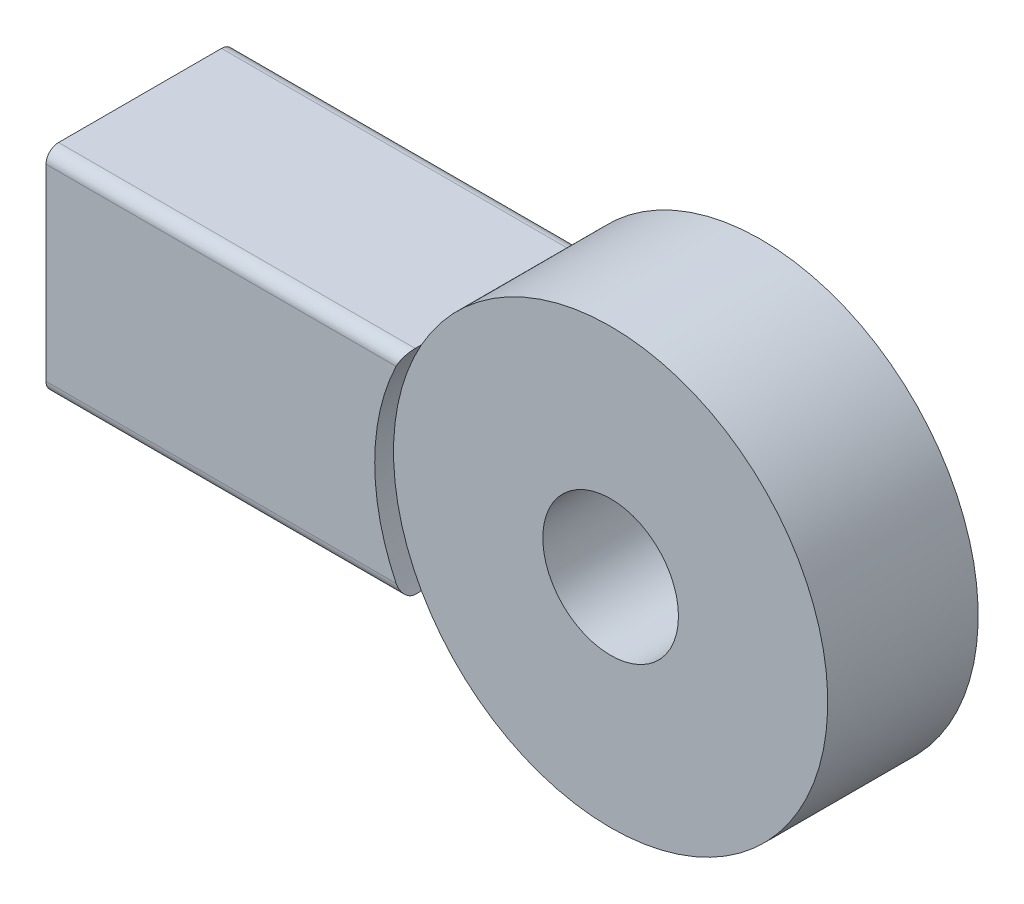
ISO-10303-21;
HEADER;
FILE_DESCRIPTION(('STEP AP214'),'2;1');
FILE_NAME('part.step','',(''),(''),'','','');
FILE_SCHEMA(('AUTOMOTIVE_DESIGN { 1 0 10303 214 1 1 1 1 }'));
ENDSEC;
DATA;
#1=APPLICATION_CONTEXT('core data for automotive mechanical design processes');
#2=APPLICATION_PROTOCOL_DEFINITION('international standard','automotive_design',2000,#1);
#3=PRODUCT_CONTEXT('',#1,'mechanical');
#4=PRODUCT('Part','Part','',(#3));
#5=PRODUCT_RELATED_PRODUCT_CATEGORY('part','',(#4));
#6=PRODUCT_DEFINITION_FORMATION('','',#4);
#7=PRODUCT_DEFINITION_CONTEXT('part definition',#1,'design');
#8=PRODUCT_DEFINITION('design','',#6,#7);
#9=PRODUCT_DEFINITION_SHAPE('','',#8);
#10=(LENGTH_UNIT() NAMED_UNIT(*) SI_UNIT(.MILLI.,.METRE.));
#11=(NAMED_UNIT(*) PLANE_ANGLE_UNIT() SI_UNIT($,.RADIAN.));
#12=(NAMED_UNIT(*) SI_UNIT($,.STERADIAN.) SOLID_ANGLE_UNIT());
#13=UNCERTAINTY_MEASURE_WITH_UNIT(LENGTH_MEASURE(1.E-05),#10,'distance_accuracy_value','');
#14=(GEOMETRIC_REPRESENTATION_CONTEXT(3) GLOBAL_UNCERTAINTY_ASSIGNED_CONTEXT((#13)) GLOBAL_UNIT_ASSIGNED_CONTEXT((#10,
#11,#12)) REPRESENTATION_CONTEXT('',''));
#15=CARTESIAN_POINT('',(0.,0.,0.));
#16=DIRECTION('',(0.,0.,1.));
#17=DIRECTION('',(1.,0.,0.));
#18=AXIS2_PLACEMENT_3D('',#15,#16,#17);
#19=CARTESIAN_POINT('',(0.,0.,6.));
#20=DIRECTION('',(0.,0.,-1.));
#21=DIRECTION('',(-1.,0.,0.));
#22=AXIS2_PLACEMENT_3D('',#19,#20,#21);
#23=CYLINDRICAL_SURFACE('',#22,17.3188793455627);
#24=DIRECTION('',(0.,0.,-1.));
#25=VECTOR('',#24,1.);
#26=CARTESIAN_POINT('',(-15.0905273458114,8.49820958857791,7.5));
#27=LINE('',#26,#25);
#28=CARTESIAN_POINT('',(-15.090527345814,8.49820958857791,6.));
#29=VERTEX_POINT('',#28);
#30=CARTESIAN_POINT('',(-15.090527345814,8.49820958857791,-6.));
#31=VERTEX_POINT('',#30);
#32=EDGE_CURVE('E210',#29,#31,#27,.T.);
#33=ORIENTED_EDGE('',*,*,#32,.F.);
#34=CARTESIAN_POINT('',(0.,0.,6.));
#35=DIRECTION('',(0.,0.,1.));
#36=DIRECTION('',(1.,0.,0.));
#37=AXIS2_PLACEMENT_3D('',#34,#35,#36);
#38=CIRCLE('',#37,17.3188793455627);
#39=CARTESIAN_POINT('',(-15.0905273458165,-8.49820958857336,6.));
#40=VERTEX_POINT('',#39);
#41=EDGE_CURVE('E214',#40,#29,#38,.T.);
#42=ORIENTED_EDGE('',*,*,#41,.F.);
#43=DIRECTION('',(0.,0.,-1.));
#44=VECTOR('',#43,1.);
#45=CARTESIAN_POINT('',(-15.0905273458114,-8.49820958857336,7.5));
#46=LINE('',#45,#44);
#47=CARTESIAN_POINT('',(-15.0905273458114,-8.49820958857336,-6.));
#48=VERTEX_POINT('',#47);
#49=EDGE_CURVE('E200',#40,#48,#46,.T.);
#50=ORIENTED_EDGE('',*,*,#49,.T.);
#51=CARTESIAN_POINT('',(0.,0.,-6.));
#52=DIRECTION('',(0.,0.,1.));
#53=DIRECTION('',(1.,0.,0.));
#54=AXIS2_PLACEMENT_3D('',#51,#52,#53);
#55=CIRCLE('',#54,17.3188793455627);
#56=EDGE_CURVE('E222',#48,#31,#55,.T.);
#57=ORIENTED_EDGE('',*,*,#56,.T.);
#58=EDGE_LOOP('',(#33,#42,#50,#57));
#59=FACE_BOUND('',#58,.T.);
#60=ADVANCED_FACE('F37',(#59),#23,.T.);
#61=CARTESIAN_POINT('',(0.,0.,6.));
#62=DIRECTION('',(0.,0.,-1.));
#63=DIRECTION('',(-1.,0.,0.));
#64=AXIS2_PLACEMENT_3D('',#61,#62,#63);
#65=CYLINDRICAL_SURFACE('',#64,5.41173144118846);
#66=CARTESIAN_POINT('',(0.,0.,6.));
#67=DIRECTION('',(0.,0.,1.));
#68=DIRECTION('',(1.,0.,0.));
#69=AXIS2_PLACEMENT_3D('',#66,#67,#68);
#70=CIRCLE('',#69,5.41173144118846);
#71=CARTESIAN_POINT('',(5.41173144118846,0.,6.));
#72=VERTEX_POINT('',#71);
#73=EDGE_CURVE('E211',#72,#72,#70,.T.);
#74=ORIENTED_EDGE('',*,*,#73,.T.);
#75=EDGE_LOOP('',(#74));
#76=FACE_BOUND('',#75,.T.);
#77=CARTESIAN_POINT('',(0.,0.,-6.));
#78=DIRECTION('',(0.,0.,1.));
#79=DIRECTION('',(1.,0.,0.));
#80=AXIS2_PLACEMENT_3D('',#77,#78,#79);
#81=CIRCLE('',#80,5.41173144118846);
#82=CARTESIAN_POINT('',(5.41173144118846,0.,-6.));
#83=VERTEX_POINT('',#82);
#84=EDGE_CURVE('E209',#83,#83,#81,.T.);
#85=ORIENTED_EDGE('',*,*,#84,.F.);
#86=EDGE_LOOP('',(#85));
#87=FACE_BOUND('',#86,.T.);
#88=ADVANCED_FACE('F274',(#76,#87),#65,.F.);
#89=CARTESIAN_POINT('',(0.,0.,6.));
#90=DIRECTION('',(0.,0.,1.));
#91=DIRECTION('',(1.,0.,0.));
#92=AXIS2_PLACEMENT_3D('',#89,#90,#91);
#93=PLANE('',#92);
#94=ORIENTED_EDGE('',*,*,#73,.F.);
#95=EDGE_LOOP('',(#94));
#96=FACE_BOUND('',#95,.T.);
#97=EDGE_CURVE('E216',#29,#40,#38,.T.);
#98=ORIENTED_EDGE('',*,*,#97,.T.);
#99=ORIENTED_EDGE('',*,*,#41,.T.);
#100=EDGE_LOOP('',(#98,#99));
#101=FACE_BOUND('',#100,.T.);
#102=ADVANCED_FACE('F280',(#96,#101),#93,.T.);
#103=CARTESIAN_POINT('',(0.,0.,-6.));
#104=DIRECTION('',(0.,0.,1.));
#105=DIRECTION('',(1.,0.,0.));
#106=AXIS2_PLACEMENT_3D('',#103,#104,#105);
#107=PLANE('',#106);
#108=ORIENTED_EDGE('',*,*,#84,.T.);
#109=EDGE_LOOP('',(#108));
#110=FACE_BOUND('',#109,.T.);
#111=EDGE_CURVE('E215',#31,#48,#55,.T.);
#112=ORIENTED_EDGE('',*,*,#111,.F.);
#113=ORIENTED_EDGE('',*,*,#56,.F.);
#114=EDGE_LOOP('',(#112,#113));
#115=FACE_BOUND('',#114,.T.);
#116=ADVANCED_FACE('F284',(#110,#115),#107,.F.);
#117=CARTESIAN_POINT('',(0.,0.,7.5));
#118=DIRECTION('',(0.,0.,-1.));
#119=DIRECTION('',(-1.,0.,0.));
#120=AXIS2_PLACEMENT_3D('',#117,#118,#119);
#121=CYLINDRICAL_SURFACE('',#120,17.3188793455627);
#122=CARTESIAN_POINT('',(0.,0.,-7.5));
#123=DIRECTION('',(0.,0.,1.));
#124=DIRECTION('',(1.,0.,0.));
#125=AXIS2_PLACEMENT_3D('',#122,#123,#124);
#126=CIRCLE('',#125,17.3188793455627);
#127=CARTESIAN_POINT('',(-15.6115481215642,7.49820958857791,-7.5));
#128=VERTEX_POINT('',#127);
#129=CARTESIAN_POINT('',(-15.6115481215664,-7.49820958857336,-7.5));
#130=VERTEX_POINT('',#129);
#131=EDGE_CURVE('E182',#128,#130,#126,.T.);
#132=ORIENTED_EDGE('',*,*,#131,.F.);
#133=CARTESIAN_POINT('',(-15.6115481215642,7.49820958857791,-7.5));
#134=CARTESIAN_POINT('',(-15.5817086899096,7.56037293676821,-7.50001226886464));
#135=CARTESIAN_POINT('',(-15.5514711763874,7.62234182119367,-7.49420452643146));
#136=CARTESIAN_POINT('',(-15.4910711134956,7.74433949699365,-7.47122314782866));
#137=CARTESIAN_POINT('',(-15.4609088554028,7.80436393539289,-7.45402564056226));
#138=CARTESIAN_POINT('',(-15.4016380076448,7.92069658419375,-7.40852148658468));
#139=CARTESIAN_POINT('',(-15.3725303574758,7.97700151613102,-7.38020518818983));
#140=CARTESIAN_POINT('',(-15.31651251662,8.08403751102646,-7.31289391765487));
#141=CARTESIAN_POINT('',(-15.2896008204767,8.13477240096261,-7.27390634252119));
#142=CARTESIAN_POINT('',(-15.2403475105873,8.22666356507234,-7.18785192815008));
#143=CARTESIAN_POINT('',(-15.2178561007495,8.26814496664267,-7.14122033384483));
#144=CARTESIAN_POINT('',(-15.1772897478211,8.34237687893656,-7.03974223449718));
#145=CARTESIAN_POINT('',(-15.1592123652538,8.37513221316412,-6.98490029418177));
#146=CARTESIAN_POINT('',(-15.1305913219278,8.42671685691229,-6.87561109888433));
#147=CARTESIAN_POINT('',(-15.1194069344571,8.44673990899789,-6.82189430691827));
#148=CARTESIAN_POINT('',(-15.1022668972775,8.47734818767464,-6.71110910815172));
#149=CARTESIAN_POINT('',(-15.0962966953305,8.48795968221793,-6.65405050662919));
#150=CARTESIAN_POINT('',(-15.0922773946951,8.4951012390661,-6.58043265323197));
#151=CARTESIAN_POINT('',(-15.0916212223593,8.49626686184314,-6.56436413889287));
#152=CARTESIAN_POINT('',(-15.0907468987479,8.49781980836139,-6.53219978678613));
#153=CARTESIAN_POINT('',(-15.0905281466029,8.49820819975973,-6.51610401694004));
#154=CARTESIAN_POINT('',(-15.090527345814,8.49820958857791,-6.49999999999986));
#155=B_SPLINE_CURVE_WITH_KNOTS('',3,(#133,#134,#135,#136,#137,#138,#139,#140,#141,#142,#143,
#144,#145,#146,#147,#148,#149,#150,#151,#152,#153,#154),.UNSPECIFIED.,.F.,.F.,(4,2,2,2,2,2,2,2,
2,2,4),(0.,0.206621395314043,0.413677211717414,0.620913161992713,0.828005824783278,
1.02590954804697,1.22370364810248,1.39794753619491,1.57170355968314,1.62005946754448,
1.66834890476721),.UNSPECIFIED.);
#156=CARTESIAN_POINT('',(-15.0905273458114,8.49820958857791,-6.5));
#157=VERTEX_POINT('',#156);
#158=EDGE_CURVE('E248',#128,#157,#155,.T.);
#159=ORIENTED_EDGE('',*,*,#158,.T.);
#160=EDGE_CURVE('E206',#31,#157,#27,.T.);
#161=ORIENTED_EDGE('',*,*,#160,.F.);
#162=ORIENTED_EDGE('',*,*,#111,.T.);
#163=CARTESIAN_POINT('',(-15.0905273458114,-8.49820958857336,-6.5));
#164=VERTEX_POINT('',#163);
#165=EDGE_CURVE('E192',#48,#164,#46,.T.);
#166=ORIENTED_EDGE('',*,*,#165,.T.);
#167=CARTESIAN_POINT('',(-15.0905273458114,-8.49820958857336,-6.5));
#168=CARTESIAN_POINT('',(-15.090526070343,-8.49821110936551,-6.52564127106686));
#169=CARTESIAN_POINT('',(-15.0910831841491,-8.4972226419363,-6.55126905412679));
#170=CARTESIAN_POINT('',(-15.0932966633545,-8.49329060426034,-6.6023175464394));
#171=CARTESIAN_POINT('',(-15.0949526431046,-8.49034771991979,-6.62773832517346));
#172=CARTESIAN_POINT('',(-15.1015202935907,-8.47866442954377,-6.70318406085138));
#173=CARTESIAN_POINT('',(-15.1080320822721,-8.46706878591032,-6.75266327798923));
#174=CARTESIAN_POINT('',(-15.1249403653583,-8.43682733703322,-6.84861177784481));
#175=CARTESIAN_POINT('',(-15.1353331797248,-8.41818821031142,-6.89508386314132));
#176=CARTESIAN_POINT('',(-15.1594741224144,-8.37463697649515,-6.98407792627637));
#177=CARTESIAN_POINT('',(-15.1732252333337,-8.34971929261212,-7.02659634615031));
#178=CARTESIAN_POINT('',(-15.2043010681082,-8.29300360666035,-7.10904934097898));
#179=CARTESIAN_POINT('',(-15.2217791462088,-8.26090576966955,-7.14871875964377));
#180=CARTESIAN_POINT('',(-15.2591021406383,-8.19175976285045,-7.22217385246548));
#181=CARTESIAN_POINT('',(-15.2789477506868,-8.15471014169633,-7.25595779492697));
#182=CARTESIAN_POINT('',(-15.3228946338098,-8.07186057538483,-7.32098972172137));
#183=CARTESIAN_POINT('',(-15.3472198973286,-8.02554445021885,-7.35142884830177));
#184=CARTESIAN_POINT('',(-15.3972613667249,-7.92911627829938,-7.40406912486916));
#185=CARTESIAN_POINT('',(-15.4229785286742,-7.8790016126821,-7.42626452794686));
#186=CARTESIAN_POINT('',(-15.4758705875815,-7.77460665379668,-7.4626783094066));
#187=CARTESIAN_POINT('',(-15.5030660743388,-7.72024653887368,-7.47663775385149));
#188=CARTESIAN_POINT('',(-15.5574635926515,-7.61004451272393,-7.4952977335234));
#189=CARTESIAN_POINT('',(-15.5846655789739,-7.55420441756711,-7.5000091281706));
#190=CARTESIAN_POINT('',(-15.6115481215664,-7.49820958857336,-7.5));
#191=B_SPLINE_CURVE_WITH_KNOTS('',3,(#167,#168,#169,#170,#171,#172,#173,#174,#175,#176,#177,
#178,#179,#180,#181,#182,#183,#184,#185,#186,#187,#188,#189,#190),.UNSPECIFIED.,.F.,.F.,(4,2,2,
2,2,2,2,2,2,2,2,4),(0.,0.076872527578372,0.153718090848827,0.306607807097266,0.459352917954637,
0.612234182484493,0.773406033554011,0.934625226738537,1.11546271867021,1.29642604144407,
1.48281140739806,1.668977781161),.UNSPECIFIED.);
#192=EDGE_CURVE('E242',#164,#130,#191,.T.);
#193=ORIENTED_EDGE('',*,*,#192,.T.);
#194=EDGE_LOOP('',(#132,#159,#161,#162,#166,#193));
#195=FACE_BOUND('',#194,.T.);
#196=ADVANCED_FACE('F286',(#195),#121,.F.);
#197=CARTESIAN_POINT('',(-15.0905273458114,8.49820958857791,6.5));
#198=VERTEX_POINT('',#197);
#199=EDGE_CURVE('E207',#198,#29,#27,.T.);
#200=ORIENTED_EDGE('',*,*,#199,.F.);
#201=CARTESIAN_POINT('',(-15.0905273458114,8.49820958857791,6.5));
#202=CARTESIAN_POINT('',(-15.0905260703414,8.49821110937006,6.52564127106691));
#203=CARTESIAN_POINT('',(-15.0910831841468,8.49722264194084,6.55126905412688));
#204=CARTESIAN_POINT('',(-15.0932966633517,8.49329060426487,6.60231754643951));
#205=CARTESIAN_POINT('',(-15.094952643102,8.49034771992432,6.62773832517357));
#206=CARTESIAN_POINT('',(-15.1015202935883,8.4786644295483,6.70318406085144));
#207=CARTESIAN_POINT('',(-15.1080320822696,8.46706878591486,6.75266327798925));
#208=CARTESIAN_POINT('',(-15.1249403653557,8.43682733703778,6.84861177784478));
#209=CARTESIAN_POINT('',(-15.1353331797222,8.41818821031599,6.89508386314128));
#210=CARTESIAN_POINT('',(-15.1594741224119,8.37463697649973,6.98407792627632));
#211=CARTESIAN_POINT('',(-15.1732252333312,8.34971929261669,7.02659634615027));
#212=CARTESIAN_POINT('',(-15.2043010681057,8.29300360666493,7.10904934097895));
#213=CARTESIAN_POINT('',(-15.2217791462063,8.26090576967413,7.14871875964374));
#214=CARTESIAN_POINT('',(-15.2591021406359,8.19175976285505,7.22217385246543));
#215=CARTESIAN_POINT('',(-15.2789477506844,8.15471014170093,7.25595779492692));
#216=CARTESIAN_POINT('',(-15.3228946338073,8.07186057538945,7.32098972172132));
#217=CARTESIAN_POINT('',(-15.3472198973262,8.02554445022348,7.35142884830173));
#218=CARTESIAN_POINT('',(-15.3972613667225,7.92911627830401,7.40406912486912));
#219=CARTESIAN_POINT('',(-15.4229785286719,7.87900161268674,7.42626452794683));
#220=CARTESIAN_POINT('',(-15.4758705875792,7.7746066538013,7.46267830940658));
#221=CARTESIAN_POINT('',(-15.5030660743365,7.72024653887829,7.47663775385148));
#222=CARTESIAN_POINT('',(-15.5574635926492,7.61004451272851,7.49529773352339));
#223=CARTESIAN_POINT('',(-15.5846655789717,7.55420441757167,7.5000091281706));
#224=CARTESIAN_POINT('',(-15.6115481215642,7.49820958857791,7.5));
#225=B_SPLINE_CURVE_WITH_KNOTS('',3,(#201,#202,#203,#204,#205,#206,#207,#208,#209,#210,#211,
#212,#213,#214,#215,#216,#217,#218,#219,#220,#221,#222,#223,#224),.UNSPECIFIED.,.F.,.F.,(4,2,2,
2,2,2,2,2,2,2,2,4),(0.,0.0768725275784228,0.153718090848873,0.306607807097194,0.459352917954536,
0.612234182484405,0.773406033553924,0.934625226738429,1.11546271867012,1.29642604144399,
1.48281140739806,1.66897778116108),.UNSPECIFIED.);
#226=CARTESIAN_POINT('',(-15.6115481215642,7.49820958857791,7.5));
#227=VERTEX_POINT('',#226);
#228=EDGE_CURVE('E11',#198,#227,#225,.T.);
#229=ORIENTED_EDGE('',*,*,#228,.T.);
#230=CARTESIAN_POINT('',(0.,0.,7.5));
#231=DIRECTION('',(0.,0.,1.));
#232=DIRECTION('',(1.,0.,0.));
#233=AXIS2_PLACEMENT_3D('',#230,#231,#232);
#234=CIRCLE('',#233,17.3188793455627);
#235=CARTESIAN_POINT('',(-15.6115481215664,-7.49820958857336,7.5));
#236=VERTEX_POINT('',#235);
#237=EDGE_CURVE('E186',#227,#236,#234,.T.);
#238=ORIENTED_EDGE('',*,*,#237,.T.);
#239=CARTESIAN_POINT('',(-15.6115481215664,-7.49820958857336,7.5));
#240=CARTESIAN_POINT('',(-15.5817086899118,-7.56037293676366,7.50001226886464));
#241=CARTESIAN_POINT('',(-15.5514711763896,-7.6223418211891,7.49420452643146));
#242=CARTESIAN_POINT('',(-15.4910711134979,-7.74433949698907,7.47122314782867));
#243=CARTESIAN_POINT('',(-15.4609088554052,-7.8043639353883,7.45402564056228));
#244=CARTESIAN_POINT('',(-15.4016380076472,-7.92069658418915,7.4085214865847));
#245=CARTESIAN_POINT('',(-15.3725303574782,-7.97700151612641,7.38020518818986));
#246=CARTESIAN_POINT('',(-15.3165125166224,-8.08403751102184,7.31289391765493));
#247=CARTESIAN_POINT('',(-15.2896008204792,-8.13477240095798,7.27390634252126));
#248=CARTESIAN_POINT('',(-15.2403475105898,-8.22666356506771,7.18785192815017));
#249=CARTESIAN_POINT('',(-15.217856100752,-8.26814496663804,7.14122033384493));
#250=CARTESIAN_POINT('',(-15.1772897478236,-8.34237687893193,7.03974223449731));
#251=CARTESIAN_POINT('',(-15.1592123652564,-8.37513221315949,6.98490029418191));
#252=CARTESIAN_POINT('',(-15.1305913219303,-8.42671685690768,6.87561109888448));
#253=CARTESIAN_POINT('',(-15.1194069344597,-8.44673990899329,6.82189430691843));
#254=CARTESIAN_POINT('',(-15.1022668972801,-8.47734818767005,6.71110910815189));
#255=CARTESIAN_POINT('',(-15.096296695333,-8.48795968221336,6.65405050662936));
#256=CARTESIAN_POINT('',(-15.0922773946977,-8.49510123906154,6.58043265323209));
#257=CARTESIAN_POINT('',(-15.0916212223619,-8.49626686183858,6.56436413889294));
#258=CARTESIAN_POINT('',(-15.0907468987505,-8.49781980835684,6.53219978678609));
#259=CARTESIAN_POINT('',(-15.0905281466054,-8.49820819975518,6.51610401693995));
#260=CARTESIAN_POINT('',(-15.0905273458165,-8.49820958857336,6.49999999999972));
#261=B_SPLINE_CURVE_WITH_KNOTS('',3,(#239,#240,#241,#242,#243,#244,#245,#246,#247,#248,#249,
#250,#251,#252,#253,#254,#255,#256,#257,#258,#259,#260),.UNSPECIFIED.,.F.,.F.,(4,2,2,2,2,2,2,2,
2,2,4),(0.,0.206621395313985,0.4136772117173,0.620913161992537,0.828005824783047,
1.0259095480467,1.22370364810217,1.3979475361946,1.57170355968284,1.62005946754433,
1.66834890476721),.UNSPECIFIED.);
#262=CARTESIAN_POINT('',(-15.0905273458114,-8.49820958857336,6.5));
#263=VERTEX_POINT('',#262);
#264=EDGE_CURVE('E50',#236,#263,#261,.T.);
#265=ORIENTED_EDGE('',*,*,#264,.T.);
#266=EDGE_CURVE('E197',#263,#40,#46,.T.);
#267=ORIENTED_EDGE('',*,*,#266,.T.);
#268=ORIENTED_EDGE('',*,*,#97,.F.);
#269=EDGE_LOOP('',(#200,#229,#238,#265,#267,#268));
#270=FACE_BOUND('',#269,.T.);
#271=ADVANCED_FACE('F254',(#270),#121,.F.);
#272=CARTESIAN_POINT('',(0.,8.49820958857791,7.5));
#273=DIRECTION('',(0.,-1.,0.));
#274=DIRECTION('',(0.,0.,-1.));
#275=AXIS2_PLACEMENT_3D('',#272,#273,#274);
#276=PLANE('',#275);
#277=ORIENTED_EDGE('',*,*,#160,.T.);
#278=DIRECTION('',(-1.,0.,0.));
#279=VECTOR('',#278,1.);
#280=CARTESIAN_POINT('',(0.,8.49820958857791,-6.5));
#281=LINE('',#280,#279);
#282=CARTESIAN_POINT('',(-43.539982068353,8.49820958857791,-6.5));
#283=VERTEX_POINT('',#282);
#284=EDGE_CURVE('E226',#157,#283,#281,.T.);
#285=ORIENTED_EDGE('',*,*,#284,.T.);
#286=DIRECTION('',(0.,0.,-1.));
#287=VECTOR('',#286,1.);
#288=CARTESIAN_POINT('',(-43.539982068353,8.49820958857791,7.5));
#289=LINE('',#288,#287);
#290=CARTESIAN_POINT('',(-43.539982068353,8.49820958857791,6.5));
#291=VERTEX_POINT('',#290);
#292=EDGE_CURVE('E203',#291,#283,#289,.T.);
#293=ORIENTED_EDGE('',*,*,#292,.F.);
#294=DIRECTION('',(-1.,0.,0.));
#295=VECTOR('',#294,1.);
#296=CARTESIAN_POINT('',(-15.0905273458114,8.49820958857791,6.5));
#297=LINE('',#296,#295);
#298=EDGE_CURVE('E219',#291,#198,#297,.F.);
#299=ORIENTED_EDGE('',*,*,#298,.T.);
#300=ORIENTED_EDGE('',*,*,#199,.T.);
#301=ORIENTED_EDGE('',*,*,#32,.T.);
#302=EDGE_LOOP('',(#277,#285,#293,#299,#300,#301));
#303=FACE_BOUND('',#302,.T.);
#304=ADVANCED_FACE('F327',(#303),#276,.F.);
#305=CARTESIAN_POINT('',(-43.539982068353,0.,7.5));
#306=DIRECTION('',(-1.,0.,0.));
#307=DIRECTION('',(0.,0.,1.));
#308=AXIS2_PLACEMENT_3D('',#305,#306,#307);
#309=PLANE('',#308);
#310=DIRECTION('',(0.,0.,-1.));
#311=VECTOR('',#310,1.);
#312=CARTESIAN_POINT('',(-43.539982068353,6.49820958857791,5.5));
#313=LINE('',#312,#311);
#314=CARTESIAN_POINT('',(-43.539982068353,6.49820958857791,5.5));
#315=VERTEX_POINT('',#314);
#316=CARTESIAN_POINT('',(-43.539982068353,6.49820958857791,-5.5));
#317=VERTEX_POINT('',#316);
#318=EDGE_CURVE('E150',#315,#317,#313,.T.);
#319=ORIENTED_EDGE('',*,*,#318,.F.);
#320=DIRECTION('',(0.,1.,0.));
#321=VECTOR('',#320,1.);
#322=CARTESIAN_POINT('',(-43.539982068353,-6.49820958857336,5.5));
#323=LINE('',#322,#321);
#324=CARTESIAN_POINT('',(-43.539982068353,-6.49820958857336,5.5));
#325=VERTEX_POINT('',#324);
#326=EDGE_CURVE('E167',#325,#315,#323,.T.);
#327=ORIENTED_EDGE('',*,*,#326,.F.);
#328=DIRECTION('',(0.,0.,1.));
#329=VECTOR('',#328,1.);
#330=CARTESIAN_POINT('',(-43.539982068353,-6.49820958857336,-5.5));
#331=LINE('',#330,#329);
#332=CARTESIAN_POINT('',(-43.539982068353,-6.49820958857336,-5.5));
#333=VERTEX_POINT('',#332);
#334=EDGE_CURVE('E170',#333,#325,#331,.T.);
#335=ORIENTED_EDGE('',*,*,#334,.F.);
#336=DIRECTION('',(0.,-1.,0.));
#337=VECTOR('',#336,1.);
#338=CARTESIAN_POINT('',(-43.539982068353,6.49820958857791,-5.5));
#339=LINE('',#338,#337);
#340=EDGE_CURVE('E176',#317,#333,#339,.T.);
#341=ORIENTED_EDGE('',*,*,#340,.F.);
#342=EDGE_LOOP('',(#319,#327,#335,#341));
#343=FACE_BOUND('',#342,.T.);
#344=ORIENTED_EDGE('',*,*,#292,.T.);
#345=CARTESIAN_POINT('',(-43.539982068353,7.49820958857791,-6.5));
#346=DIRECTION('',(-1.,0.,0.));
#347=DIRECTION('',(0.,0.,1.));
#348=AXIS2_PLACEMENT_3D('',#345,#346,#347);
#349=CIRCLE('',#348,1.);
#350=CARTESIAN_POINT('',(-43.539982068353,7.49820958857791,-7.5));
#351=VERTEX_POINT('',#350);
#352=EDGE_CURVE('E235',#283,#351,#349,.T.);
#353=ORIENTED_EDGE('',*,*,#352,.T.);
#354=DIRECTION('',(0.,1.,0.));
#355=VECTOR('',#354,1.);
#356=CARTESIAN_POINT('',(-43.539982068353,0.,-7.5));
#357=LINE('',#356,#355);
#358=CARTESIAN_POINT('',(-43.539982068353,-7.49820958857336,-7.5));
#359=VERTEX_POINT('',#358);
#360=EDGE_CURVE('E189',#359,#351,#357,.T.);
#361=ORIENTED_EDGE('',*,*,#360,.F.);
#362=CARTESIAN_POINT('',(-43.539982068353,-7.49820958857336,-6.5));
#363=DIRECTION('',(-1.,0.,0.));
#364=DIRECTION('',(0.,0.,1.));
#365=AXIS2_PLACEMENT_3D('',#362,#363,#364);
#366=CIRCLE('',#365,1.);
#367=CARTESIAN_POINT('',(-43.539982068353,-8.49820958857336,-6.5));
#368=VERTEX_POINT('',#367);
#369=EDGE_CURVE('E233',#359,#368,#366,.T.);
#370=ORIENTED_EDGE('',*,*,#369,.T.);
#371=DIRECTION('',(0.,0.,-1.));
#372=VECTOR('',#371,1.);
#373=CARTESIAN_POINT('',(-43.539982068353,-8.49820958857336,7.5));
#374=LINE('',#373,#372);
#375=CARTESIAN_POINT('',(-43.539982068353,-8.49820958857336,6.5));
#376=VERTEX_POINT('',#375);
#377=EDGE_CURVE('E199',#376,#368,#374,.T.);
#378=ORIENTED_EDGE('',*,*,#377,.F.);
#379=CARTESIAN_POINT('',(-43.539982068353,-7.49820958857336,6.5));
#380=DIRECTION('',(-1.,0.,0.));
#381=DIRECTION('',(0.,0.,1.));
#382=AXIS2_PLACEMENT_3D('',#379,#380,#381);
#383=CIRCLE('',#382,1.);
#384=CARTESIAN_POINT('',(-43.539982068353,-7.49820958857336,7.5));
#385=VERTEX_POINT('',#384);
#386=EDGE_CURVE('E229',#376,#385,#383,.T.);
#387=ORIENTED_EDGE('',*,*,#386,.T.);
#388=DIRECTION('',(0.,1.,0.));
#389=VECTOR('',#388,1.);
#390=CARTESIAN_POINT('',(-43.539982068353,0.,7.5));
#391=LINE('',#390,#389);
#392=CARTESIAN_POINT('',(-43.539982068353,7.49820958857791,7.5));
#393=VERTEX_POINT('',#392);
#394=EDGE_CURVE('E188',#385,#393,#391,.T.);
#395=ORIENTED_EDGE('',*,*,#394,.T.);
#396=CARTESIAN_POINT('',(-43.539982068353,7.49820958857791,6.5));
#397=DIRECTION('',(-1.,0.,0.));
#398=DIRECTION('',(0.,0.,1.));
#399=AXIS2_PLACEMENT_3D('',#396,#397,#398);
#400=CIRCLE('',#399,1.);
#401=EDGE_CURVE('E231',#393,#291,#400,.T.);
#402=ORIENTED_EDGE('',*,*,#401,.T.);
#403=EDGE_LOOP('',(#344,#353,#361,#370,#378,#387,#395,#402));
#404=FACE_BOUND('',#403,.T.);
#405=ADVANCED_FACE('F319',(#343,#404),#309,.T.);
#406=CARTESIAN_POINT('',(0.,-8.49820958857336,7.5));
#407=DIRECTION('',(0.,-1.,0.));
#408=DIRECTION('',(0.,0.,-1.));
#409=AXIS2_PLACEMENT_3D('',#406,#407,#408);
#410=PLANE('',#409);
#411=ORIENTED_EDGE('',*,*,#377,.T.);
#412=DIRECTION('',(-1.,0.,0.));
#413=VECTOR('',#412,1.);
#414=CARTESIAN_POINT('',(-15.0905273458114,-8.49820958857336,-6.5));
#415=LINE('',#414,#413);
#416=EDGE_CURVE('E313',#368,#164,#415,.F.);
#417=ORIENTED_EDGE('',*,*,#416,.T.);
#418=ORIENTED_EDGE('',*,*,#165,.F.);
#419=ORIENTED_EDGE('',*,*,#49,.F.);
#420=ORIENTED_EDGE('',*,*,#266,.F.);
#421=DIRECTION('',(-1.,0.,0.));
#422=VECTOR('',#421,1.);
#423=CARTESIAN_POINT('',(0.,-8.49820958857336,6.5));
#424=LINE('',#423,#422);
#425=EDGE_CURVE('E330',#263,#376,#424,.T.);
#426=ORIENTED_EDGE('',*,*,#425,.T.);
#427=EDGE_LOOP('',(#411,#417,#418,#419,#420,#426));
#428=FACE_BOUND('',#427,.T.);
#429=ADVANCED_FACE('F302',(#428),#410,.T.);
#430=CARTESIAN_POINT('',(0.,0.,7.5));
#431=DIRECTION('',(0.,0.,1.));
#432=DIRECTION('',(1.,0.,0.));
#433=AXIS2_PLACEMENT_3D('',#430,#431,#432);
#434=PLANE('',#433);
#435=ORIENTED_EDGE('',*,*,#237,.F.);
#436=DIRECTION('',(-1.,0.,0.));
#437=VECTOR('',#436,1.);
#438=CARTESIAN_POINT('',(-43.539982068353,7.49820958857791,7.5));
#439=LINE('',#438,#437);
#440=EDGE_CURVE('E334',#227,#393,#439,.T.);
#441=ORIENTED_EDGE('',*,*,#440,.T.);
#442=ORIENTED_EDGE('',*,*,#394,.F.);
#443=DIRECTION('',(-1.,0.,0.));
#444=VECTOR('',#443,1.);
#445=CARTESIAN_POINT('',(0.,-7.49820958857336,7.5));
#446=LINE('',#445,#444);
#447=EDGE_CURVE('E57',#385,#236,#446,.F.);
#448=ORIENTED_EDGE('',*,*,#447,.T.);
#449=EDGE_LOOP('',(#435,#441,#442,#448));
#450=FACE_BOUND('',#449,.T.);
#451=ADVANCED_FACE('F340',(#450),#434,.T.);
#452=CARTESIAN_POINT('',(0.,0.,-7.5));
#453=DIRECTION('',(0.,0.,1.));
#454=DIRECTION('',(1.,0.,0.));
#455=AXIS2_PLACEMENT_3D('',#452,#453,#454);
#456=PLANE('',#455);
#457=ORIENTED_EDGE('',*,*,#360,.T.);
#458=DIRECTION('',(-1.,0.,0.));
#459=VECTOR('',#458,1.);
#460=CARTESIAN_POINT('',(0.,7.49820958857791,-7.5));
#461=LINE('',#460,#459);
#462=EDGE_CURVE('E240',#351,#128,#461,.F.);
#463=ORIENTED_EDGE('',*,*,#462,.T.);
#464=ORIENTED_EDGE('',*,*,#131,.T.);
#465=DIRECTION('',(-1.,0.,0.));
#466=VECTOR('',#465,1.);
#467=CARTESIAN_POINT('',(-43.539982068353,-7.49820958857336,-7.5));
#468=LINE('',#467,#466);
#469=EDGE_CURVE('E237',#130,#359,#468,.T.);
#470=ORIENTED_EDGE('',*,*,#469,.T.);
#471=EDGE_LOOP('',(#457,#463,#464,#470));
#472=FACE_BOUND('',#471,.T.);
#473=ADVANCED_FACE('F316',(#472),#456,.F.);
#474=CARTESIAN_POINT('',(-17.539982068353,6.49820958857791,5.5));
#475=DIRECTION('',(0.,1.,0.));
#476=DIRECTION('',(0.,0.,1.));
#477=AXIS2_PLACEMENT_3D('',#474,#475,#476);
#478=PLANE('',#477);
#479=ORIENTED_EDGE('',*,*,#318,.T.);
#480=DIRECTION('',(-1.,0.,0.));
#481=VECTOR('',#480,1.);
#482=CARTESIAN_POINT('',(-17.539982068353,6.49820958857791,-5.5));
#483=LINE('',#482,#481);
#484=CARTESIAN_POINT('',(-17.539982068353,6.49820958857791,-5.5));
#485=VERTEX_POINT('',#484);
#486=EDGE_CURVE('E143',#485,#317,#483,.T.);
#487=ORIENTED_EDGE('',*,*,#486,.F.);
#488=DIRECTION('',(0.,0.,-1.));
#489=VECTOR('',#488,1.);
#490=CARTESIAN_POINT('',(-17.539982068353,6.49820958857791,5.5));
#491=LINE('',#490,#489);
#492=CARTESIAN_POINT('',(-17.539982068353,6.49820958857791,5.5));
#493=VERTEX_POINT('',#492);
#494=EDGE_CURVE('E147',#493,#485,#491,.T.);
#495=ORIENTED_EDGE('',*,*,#494,.F.);
#496=DIRECTION('',(-1.,0.,0.));
#497=VECTOR('',#496,1.);
#498=CARTESIAN_POINT('',(-17.539982068353,6.49820958857791,5.5));
#499=LINE('',#498,#497);
#500=EDGE_CURVE('E180',#493,#315,#499,.T.);
#501=ORIENTED_EDGE('',*,*,#500,.T.);
#502=EDGE_LOOP('',(#479,#487,#495,#501));
#503=FACE_BOUND('',#502,.T.);
#504=ADVANCED_FACE('F145',(#503),#478,.F.);
#505=CARTESIAN_POINT('',(-17.539982068353,-6.49820958857336,5.5));
#506=DIRECTION('',(0.,0.,1.));
#507=DIRECTION('',(1.,0.,0.));
#508=AXIS2_PLACEMENT_3D('',#505,#506,#507);
#509=PLANE('',#508);
#510=ORIENTED_EDGE('',*,*,#326,.T.);
#511=ORIENTED_EDGE('',*,*,#500,.F.);
#512=DIRECTION('',(0.,1.,0.));
#513=VECTOR('',#512,1.);
#514=CARTESIAN_POINT('',(-17.539982068353,-6.49820958857336,5.5));
#515=LINE('',#514,#513);
#516=CARTESIAN_POINT('',(-17.539982068353,-6.49820958857336,5.5));
#517=VERTEX_POINT('',#516);
#518=EDGE_CURVE('E155',#517,#493,#515,.T.);
#519=ORIENTED_EDGE('',*,*,#518,.F.);
#520=DIRECTION('',(-1.,0.,0.));
#521=VECTOR('',#520,1.);
#522=CARTESIAN_POINT('',(-17.539982068353,-6.49820958857336,5.5));
#523=LINE('',#522,#521);
#524=EDGE_CURVE('E183',#517,#325,#523,.T.);
#525=ORIENTED_EDGE('',*,*,#524,.T.);
#526=EDGE_LOOP('',(#510,#511,#519,#525));
#527=FACE_BOUND('',#526,.T.);
#528=ADVANCED_FACE('F382',(#527),#509,.F.);
#529=CARTESIAN_POINT('',(-17.539982068353,-6.49820958857336,-5.5));
#530=DIRECTION('',(0.,-1.,0.));
#531=DIRECTION('',(0.,0.,-1.));
#532=AXIS2_PLACEMENT_3D('',#529,#530,#531);
#533=PLANE('',#532);
#534=ORIENTED_EDGE('',*,*,#334,.T.);
#535=ORIENTED_EDGE('',*,*,#524,.F.);
#536=DIRECTION('',(0.,0.,1.));
#537=VECTOR('',#536,1.);
#538=CARTESIAN_POINT('',(-17.539982068353,-6.49820958857336,-5.5));
#539=LINE('',#538,#537);
#540=CARTESIAN_POINT('',(-17.539982068353,-6.49820958857336,-5.5));
#541=VERTEX_POINT('',#540);
#542=EDGE_CURVE('E163',#541,#517,#539,.T.);
#543=ORIENTED_EDGE('',*,*,#542,.F.);
#544=DIRECTION('',(-1.,0.,0.));
#545=VECTOR('',#544,1.);
#546=CARTESIAN_POINT('',(-17.539982068353,-6.49820958857336,-5.5));
#547=LINE('',#546,#545);
#548=EDGE_CURVE('E154',#541,#333,#547,.T.);
#549=ORIENTED_EDGE('',*,*,#548,.T.);
#550=EDGE_LOOP('',(#534,#535,#543,#549));
#551=FACE_BOUND('',#550,.T.);
#552=ADVANCED_FACE('F391',(#551),#533,.F.);
#553=CARTESIAN_POINT('',(-17.539982068353,6.49820958857791,-5.5));
#554=DIRECTION('',(0.,0.,-1.));
#555=DIRECTION('',(-1.,0.,0.));
#556=AXIS2_PLACEMENT_3D('',#553,#554,#555);
#557=PLANE('',#556);
#558=ORIENTED_EDGE('',*,*,#340,.T.);
#559=ORIENTED_EDGE('',*,*,#548,.F.);
#560=DIRECTION('',(0.,-1.,0.));
#561=VECTOR('',#560,1.);
#562=CARTESIAN_POINT('',(-17.539982068353,6.49820958857791,-5.5));
#563=LINE('',#562,#561);
#564=EDGE_CURVE('E158',#485,#541,#563,.T.);
#565=ORIENTED_EDGE('',*,*,#564,.F.);
#566=ORIENTED_EDGE('',*,*,#486,.T.);
#567=EDGE_LOOP('',(#558,#559,#565,#566));
#568=FACE_BOUND('',#567,.T.);
#569=ADVANCED_FACE('F159',(#568),#557,.F.);
#570=CARTESIAN_POINT('',(-17.539982068353,0.,0.));
#571=DIRECTION('',(-1.,0.,0.));
#572=DIRECTION('',(0.,0.,1.));
#573=AXIS2_PLACEMENT_3D('',#570,#571,#572);
#574=PLANE('',#573);
#575=ORIENTED_EDGE('',*,*,#494,.T.);
#576=ORIENTED_EDGE('',*,*,#564,.T.);
#577=ORIENTED_EDGE('',*,*,#542,.T.);
#578=ORIENTED_EDGE('',*,*,#518,.T.);
#579=EDGE_LOOP('',(#575,#576,#577,#578));
#580=FACE_BOUND('',#579,.T.);
#581=ADVANCED_FACE('F165',(#580),#574,.T.);
#582=CARTESIAN_POINT('',(0.,7.49820958857791,-6.5));
#583=DIRECTION('',(-1.,0.,0.));
#584=DIRECTION('',(0.,0.,1.));
#585=AXIS2_PLACEMENT_3D('',#582,#583,#584);
#586=CYLINDRICAL_SURFACE('',#585,1.);
#587=ORIENTED_EDGE('',*,*,#158,.F.);
#588=ORIENTED_EDGE('',*,*,#462,.F.);
#589=ORIENTED_EDGE('',*,*,#352,.F.);
#590=ORIENTED_EDGE('',*,*,#284,.F.);
#591=EDGE_LOOP('',(#587,#588,#589,#590));
#592=FACE_BOUND('',#591,.T.);
#593=ADVANCED_FACE('F262',(#592),#586,.T.);
#594=CARTESIAN_POINT('',(0.,-7.49820958857336,-6.5));
#595=DIRECTION('',(1.,0.,0.));
#596=DIRECTION('',(0.,0.,-1.));
#597=AXIS2_PLACEMENT_3D('',#594,#595,#596);
#598=CYLINDRICAL_SURFACE('',#597,1.);
#599=ORIENTED_EDGE('',*,*,#192,.F.);
#600=ORIENTED_EDGE('',*,*,#416,.F.);
#601=ORIENTED_EDGE('',*,*,#369,.F.);
#602=ORIENTED_EDGE('',*,*,#469,.F.);
#603=EDGE_LOOP('',(#599,#600,#601,#602));
#604=FACE_BOUND('',#603,.T.);
#605=ADVANCED_FACE('F258',(#604),#598,.T.);
#606=CARTESIAN_POINT('',(0.,7.49820958857791,6.5));
#607=DIRECTION('',(1.,0.,0.));
#608=DIRECTION('',(0.,0.,-1.));
#609=AXIS2_PLACEMENT_3D('',#606,#607,#608);
#610=CYLINDRICAL_SURFACE('',#609,1.);
#611=ORIENTED_EDGE('',*,*,#228,.F.);
#612=ORIENTED_EDGE('',*,*,#298,.F.);
#613=ORIENTED_EDGE('',*,*,#401,.F.);
#614=ORIENTED_EDGE('',*,*,#440,.F.);
#615=EDGE_LOOP('',(#611,#612,#613,#614));
#616=FACE_BOUND('',#615,.T.);
#617=ADVANCED_FACE('F261',(#616),#610,.T.);
#618=CARTESIAN_POINT('',(0.,-7.49820958857336,6.5));
#619=DIRECTION('',(-1.,0.,0.));
#620=DIRECTION('',(0.,0.,1.));
#621=AXIS2_PLACEMENT_3D('',#618,#619,#620);
#622=CYLINDRICAL_SURFACE('',#621,1.);
#623=ORIENTED_EDGE('',*,*,#264,.F.);
#624=ORIENTED_EDGE('',*,*,#447,.F.);
#625=ORIENTED_EDGE('',*,*,#386,.F.);
#626=ORIENTED_EDGE('',*,*,#425,.F.);
#627=EDGE_LOOP('',(#623,#624,#625,#626));
#628=FACE_BOUND('',#627,.T.);
#629=ADVANCED_FACE('F39',(#628),#622,.T.);
#630=CLOSED_SHELL('',(#60,#88,#102,#116,#196,#271,#304,#405,#429,#451,#473,#504,#528,#552,#569,
#581,#593,#605,#617,#629));
#631=MANIFOLD_SOLID_BREP('B2',#630);
#632=ADVANCED_BREP_SHAPE_REPRESENTATION('',(#18,#631),#14);
#633=SHAPE_DEFINITION_REPRESENTATION(#9,#632);
ENDSEC;
END-ISO-10303-21;
